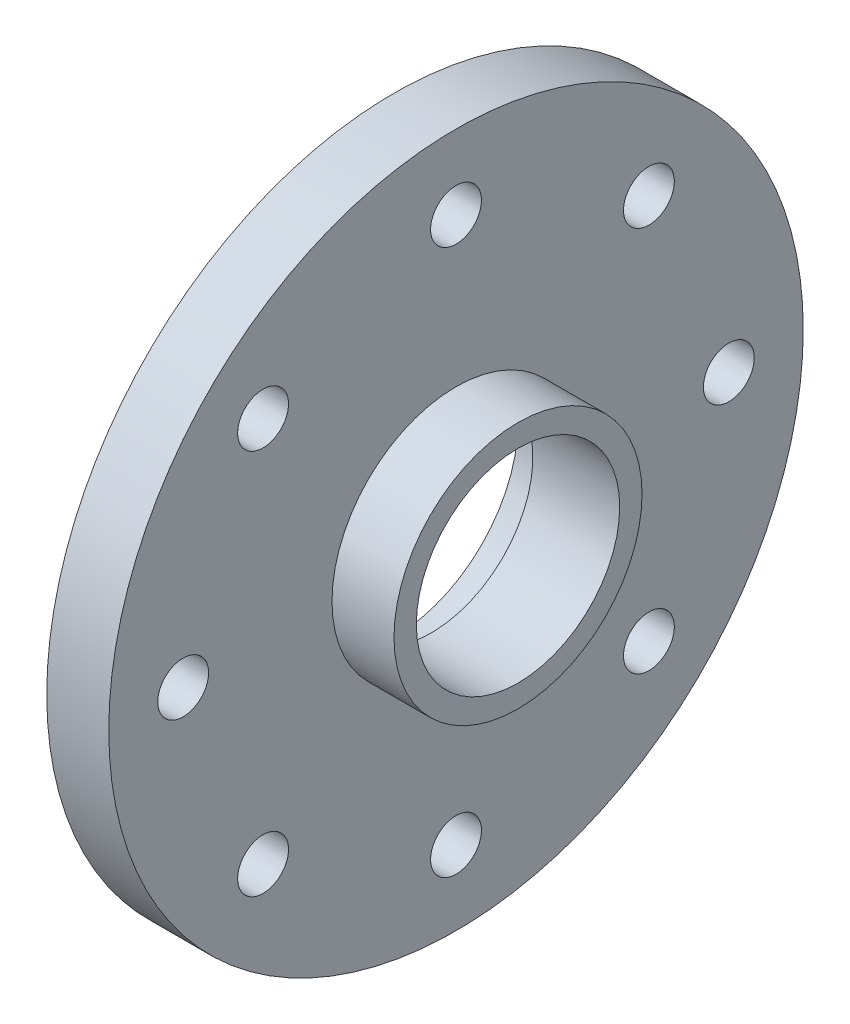
ISO-10303-21;
HEADER;
FILE_DESCRIPTION(('STEP AP214'),'2;1');
FILE_NAME('part.step','',(''),(''),'','','');
FILE_SCHEMA(('AUTOMOTIVE_DESIGN { 1 0 10303 214 1 1 1 1 }'));
ENDSEC;
DATA;
#1=APPLICATION_CONTEXT('core data for automotive mechanical design processes');
#2=APPLICATION_PROTOCOL_DEFINITION('international standard','automotive_design',2000,#1);
#3=PRODUCT_CONTEXT('',#1,'mechanical');
#4=PRODUCT('Part','Part','',(#3));
#5=PRODUCT_RELATED_PRODUCT_CATEGORY('part','',(#4));
#6=PRODUCT_DEFINITION_FORMATION('','',#4);
#7=PRODUCT_DEFINITION_CONTEXT('part definition',#1,'design');
#8=PRODUCT_DEFINITION('design','',#6,#7);
#9=PRODUCT_DEFINITION_SHAPE('','',#8);
#10=(LENGTH_UNIT() NAMED_UNIT(*) SI_UNIT(.MILLI.,.METRE.));
#11=(NAMED_UNIT(*) PLANE_ANGLE_UNIT() SI_UNIT($,.RADIAN.));
#12=(NAMED_UNIT(*) SI_UNIT($,.STERADIAN.) SOLID_ANGLE_UNIT());
#13=UNCERTAINTY_MEASURE_WITH_UNIT(LENGTH_MEASURE(1.E-05),#10,'distance_accuracy_value','');
#14=(GEOMETRIC_REPRESENTATION_CONTEXT(3) GLOBAL_UNCERTAINTY_ASSIGNED_CONTEXT((#13)) GLOBAL_UNIT_ASSIGNED_CONTEXT((#10,
#11,#12)) REPRESENTATION_CONTEXT('',''));
#15=CARTESIAN_POINT('',(0.,0.,0.));
#16=DIRECTION('',(0.,0.,1.));
#17=DIRECTION('',(1.,0.,0.));
#18=AXIS2_PLACEMENT_3D('',#15,#16,#17);
#19=CARTESIAN_POINT('',(2.5,0.,0.));
#20=DIRECTION('',(-1.,0.,0.));
#21=DIRECTION('',(0.,0.,1.));
#22=AXIS2_PLACEMENT_3D('',#19,#20,#21);
#23=CYLINDRICAL_SURFACE('',#22,4.1);
#24=CARTESIAN_POINT('',(5.,0.,0.));
#25=DIRECTION('',(1.,0.,0.));
#26=DIRECTION('',(0.,0.,-1.));
#27=AXIS2_PLACEMENT_3D('',#24,#25,#26);
#28=CIRCLE('',#27,4.1);
#29=CARTESIAN_POINT('',(5.,0.,-4.1));
#30=VERTEX_POINT('',#29);
#31=EDGE_CURVE('E72',#30,#30,#28,.T.);
#32=ORIENTED_EDGE('',*,*,#31,.T.);
#33=EDGE_LOOP('',(#32));
#34=FACE_BOUND('',#33,.T.);
#35=CARTESIAN_POINT('',(1.5,0.,0.));
#36=DIRECTION('',(-1.,0.,0.));
#37=DIRECTION('',(0.,0.,1.));
#38=AXIS2_PLACEMENT_3D('',#35,#36,#37);
#39=CIRCLE('',#38,4.1);
#40=CARTESIAN_POINT('',(1.5,0.,4.1));
#41=VERTEX_POINT('',#40);
#42=EDGE_CURVE('E53',#41,#41,#39,.T.);
#43=ORIENTED_EDGE('',*,*,#42,.T.);
#44=EDGE_LOOP('',(#43));
#45=FACE_BOUND('',#44,.T.);
#46=ADVANCED_FACE('F49',(#34,#45),#23,.F.);
#47=CARTESIAN_POINT('',(2.5,0.,0.));
#48=DIRECTION('',(1.,0.,0.));
#49=DIRECTION('',(0.,0.,-1.));
#50=AXIS2_PLACEMENT_3D('',#47,#48,#49);
#51=PLANE('',#50);
#52=CARTESIAN_POINT('',(2.5,11.,0.));
#53=DIRECTION('',(1.,0.,0.));
#54=DIRECTION('',(0.,0.,-1.));
#55=AXIS2_PLACEMENT_3D('',#52,#53,#54);
#56=CIRCLE('',#55,1.02499999999999);
#57=CARTESIAN_POINT('',(2.5,11.,-1.02499999999999));
#58=VERTEX_POINT('',#57);
#59=EDGE_CURVE('E134',#58,#58,#56,.T.);
#60=ORIENTED_EDGE('',*,*,#59,.F.);
#61=EDGE_LOOP('',(#60));
#62=FACE_BOUND('',#61,.T.);
#63=CARTESIAN_POINT('',(2.5,7.77817459305257,-7.77817459305225));
#64=DIRECTION('',(1.,0.,0.));
#65=DIRECTION('',(0.,0.,-1.));
#66=AXIS2_PLACEMENT_3D('',#63,#64,#65);
#67=CIRCLE('',#66,1.02499999999999);
#68=CARTESIAN_POINT('',(2.5,7.77817459305257,-8.80317459305224));
#69=VERTEX_POINT('',#68);
#70=EDGE_CURVE('E127',#69,#69,#67,.T.);
#71=ORIENTED_EDGE('',*,*,#70,.F.);
#72=EDGE_LOOP('',(#71));
#73=FACE_BOUND('',#72,.T.);
#74=CARTESIAN_POINT('',(2.5,7.80249897857048E-13,-11.0000000000008));
#75=DIRECTION('',(1.,0.,0.));
#76=DIRECTION('',(0.,0.,-1.));
#77=AXIS2_PLACEMENT_3D('',#74,#75,#76);
#78=CIRCLE('',#77,1.02499999999999);
#79=CARTESIAN_POINT('',(2.5,7.80249897857048E-13,-12.0250000000008));
#80=VERTEX_POINT('',#79);
#81=EDGE_CURVE('E119',#80,#80,#78,.T.);
#82=ORIENTED_EDGE('',*,*,#81,.F.);
#83=EDGE_LOOP('',(#82));
#84=FACE_BOUND('',#83,.T.);
#85=CARTESIAN_POINT('',(2.5,-7.77817459305147,-7.77817459305335));
#86=DIRECTION('',(1.,0.,0.));
#87=DIRECTION('',(0.,0.,-1.));
#88=AXIS2_PLACEMENT_3D('',#85,#86,#87);
#89=CIRCLE('',#88,1.02499999999999);
#90=CARTESIAN_POINT('',(2.5,-7.77817459305147,-8.80317459305335));
#91=VERTEX_POINT('',#90);
#92=EDGE_CURVE('E111',#91,#91,#89,.T.);
#93=ORIENTED_EDGE('',*,*,#92,.F.);
#94=EDGE_LOOP('',(#93));
#95=FACE_BOUND('',#94,.T.);
#96=CARTESIAN_POINT('',(2.5,-11.,-1.5604997957141E-12));
#97=DIRECTION('',(1.,0.,0.));
#98=DIRECTION('',(0.,0.,-1.));
#99=AXIS2_PLACEMENT_3D('',#96,#97,#98);
#100=CIRCLE('',#99,1.02499999999999);
#101=CARTESIAN_POINT('',(2.5,-11.,-1.02500000000155));
#102=VERTEX_POINT('',#101);
#103=EDGE_CURVE('E103',#102,#102,#100,.T.);
#104=ORIENTED_EDGE('',*,*,#103,.F.);
#105=EDGE_LOOP('',(#104));
#106=FACE_BOUND('',#105,.T.);
#107=CARTESIAN_POINT('',(2.5,-7.77817459305258,7.77817459305069));
#108=DIRECTION('',(1.,0.,0.));
#109=DIRECTION('',(0.,0.,-1.));
#110=AXIS2_PLACEMENT_3D('',#107,#108,#109);
#111=CIRCLE('',#110,1.02499999999999);
#112=CARTESIAN_POINT('',(2.5,-7.77817459305258,6.7531745930507));
#113=VERTEX_POINT('',#112);
#114=EDGE_CURVE('E95',#113,#113,#111,.T.);
#115=ORIENTED_EDGE('',*,*,#114,.F.);
#116=EDGE_LOOP('',(#115));
#117=FACE_BOUND('',#116,.T.);
#118=CARTESIAN_POINT('',(2.5,-7.8159700933611E-13,10.9999999999992));
#119=DIRECTION('',(1.,0.,0.));
#120=DIRECTION('',(0.,0.,-1.));
#121=AXIS2_PLACEMENT_3D('',#118,#119,#120);
#122=CIRCLE('',#121,1.02499999999999);
#123=CARTESIAN_POINT('',(2.5,-7.8159700933611E-13,9.97499999999923));
#124=VERTEX_POINT('',#123);
#125=EDGE_CURVE('E87',#124,#124,#122,.T.);
#126=ORIENTED_EDGE('',*,*,#125,.F.);
#127=EDGE_LOOP('',(#126));
#128=FACE_BOUND('',#127,.T.);
#129=CARTESIAN_POINT('',(2.5,7.77817459305147,7.77817459305179));
#130=DIRECTION('',(1.,0.,0.));
#131=DIRECTION('',(0.,0.,-1.));
#132=AXIS2_PLACEMENT_3D('',#129,#130,#131);
#133=CIRCLE('',#132,1.02499999999999);
#134=CARTESIAN_POINT('',(2.5,7.77817459305147,6.7531745930518));
#135=VERTEX_POINT('',#134);
#136=EDGE_CURVE('E79',#135,#135,#133,.T.);
#137=ORIENTED_EDGE('',*,*,#136,.F.);
#138=EDGE_LOOP('',(#137));
#139=FACE_BOUND('',#138,.T.);
#140=CARTESIAN_POINT('',(2.5,0.,0.));
#141=DIRECTION('',(1.,0.,0.));
#142=DIRECTION('',(0.,0.,-1.));
#143=AXIS2_PLACEMENT_3D('',#140,#141,#142);
#144=CIRCLE('',#143,14.);
#145=CARTESIAN_POINT('',(2.5,0.,-14.));
#146=VERTEX_POINT('',#145);
#147=EDGE_CURVE('E10',#146,#146,#144,.T.);
#148=ORIENTED_EDGE('',*,*,#147,.T.);
#149=EDGE_LOOP('',(#148));
#150=FACE_BOUND('',#149,.T.);
#151=CARTESIAN_POINT('',(2.5,0.,0.));
#152=DIRECTION('',(1.,0.,0.));
#153=DIRECTION('',(0.,0.,-1.));
#154=AXIS2_PLACEMENT_3D('',#151,#152,#153);
#155=CIRCLE('',#154,5.);
#156=CARTESIAN_POINT('',(2.5,0.,-5.));
#157=VERTEX_POINT('',#156);
#158=EDGE_CURVE('E68',#157,#157,#155,.T.);
#159=ORIENTED_EDGE('',*,*,#158,.F.);
#160=EDGE_LOOP('',(#159));
#161=FACE_BOUND('',#160,.T.);
#162=ADVANCED_FACE('F165',(#62,#73,#84,#95,#106,#117,#128,#139,#150,#161),#51,.T.);
#163=CARTESIAN_POINT('',(0.,0.,0.));
#164=DIRECTION('',(1.,0.,0.));
#165=DIRECTION('',(0.,0.,-1.));
#166=AXIS2_PLACEMENT_3D('',#163,#164,#165);
#167=PLANE('',#166);
#168=CARTESIAN_POINT('',(0.,0.,0.));
#169=DIRECTION('',(-1.,0.,0.));
#170=DIRECTION('',(0.,0.,1.));
#171=AXIS2_PLACEMENT_3D('',#168,#169,#170);
#172=CIRCLE('',#171,5.);
#173=CARTESIAN_POINT('',(0.,0.,5.));
#174=VERTEX_POINT('',#173);
#175=EDGE_CURVE('E141',#174,#174,#172,.T.);
#176=ORIENTED_EDGE('',*,*,#175,.F.);
#177=EDGE_LOOP('',(#176));
#178=FACE_BOUND('',#177,.T.);
#179=CARTESIAN_POINT('',(0.,11.,0.));
#180=DIRECTION('',(1.,0.,0.));
#181=DIRECTION('',(0.,0.,-1.));
#182=AXIS2_PLACEMENT_3D('',#179,#180,#181);
#183=CIRCLE('',#182,1.025);
#184=CARTESIAN_POINT('',(0.,11.,-1.025));
#185=VERTEX_POINT('',#184);
#186=EDGE_CURVE('E138',#185,#185,#183,.T.);
#187=ORIENTED_EDGE('',*,*,#186,.T.);
#188=EDGE_LOOP('',(#187));
#189=FACE_BOUND('',#188,.T.);
#190=CARTESIAN_POINT('',(0.,7.77817459305257,-7.77817459305225));
#191=DIRECTION('',(1.,0.,0.));
#192=DIRECTION('',(0.,0.,-1.));
#193=AXIS2_PLACEMENT_3D('',#190,#191,#192);
#194=CIRCLE('',#193,1.025);
#195=CARTESIAN_POINT('',(0.,7.77817459305257,-8.80317459305225));
#196=VERTEX_POINT('',#195);
#197=EDGE_CURVE('E131',#196,#196,#194,.T.);
#198=ORIENTED_EDGE('',*,*,#197,.T.);
#199=EDGE_LOOP('',(#198));
#200=FACE_BOUND('',#199,.T.);
#201=CARTESIAN_POINT('',(0.,7.80249897857048E-13,-11.0000000000008));
#202=DIRECTION('',(1.,0.,0.));
#203=DIRECTION('',(0.,0.,-1.));
#204=AXIS2_PLACEMENT_3D('',#201,#202,#203);
#205=CIRCLE('',#204,1.025);
#206=CARTESIAN_POINT('',(0.,7.80249897857048E-13,-12.0250000000008));
#207=VERTEX_POINT('',#206);
#208=EDGE_CURVE('E123',#207,#207,#205,.T.);
#209=ORIENTED_EDGE('',*,*,#208,.T.);
#210=EDGE_LOOP('',(#209));
#211=FACE_BOUND('',#210,.T.);
#212=CARTESIAN_POINT('',(0.,-7.77817459305147,-7.77817459305335));
#213=DIRECTION('',(1.,0.,0.));
#214=DIRECTION('',(0.,0.,-1.));
#215=AXIS2_PLACEMENT_3D('',#212,#213,#214);
#216=CIRCLE('',#215,1.025);
#217=CARTESIAN_POINT('',(0.,-7.77817459305147,-8.80317459305335));
#218=VERTEX_POINT('',#217);
#219=EDGE_CURVE('E115',#218,#218,#216,.T.);
#220=ORIENTED_EDGE('',*,*,#219,.T.);
#221=EDGE_LOOP('',(#220));
#222=FACE_BOUND('',#221,.T.);
#223=CARTESIAN_POINT('',(0.,-11.,-1.5604997957141E-12));
#224=DIRECTION('',(1.,0.,0.));
#225=DIRECTION('',(0.,0.,-1.));
#226=AXIS2_PLACEMENT_3D('',#223,#224,#225);
#227=CIRCLE('',#226,1.025);
#228=CARTESIAN_POINT('',(0.,-11.,-1.02500000000156));
#229=VERTEX_POINT('',#228);
#230=EDGE_CURVE('E107',#229,#229,#227,.T.);
#231=ORIENTED_EDGE('',*,*,#230,.T.);
#232=EDGE_LOOP('',(#231));
#233=FACE_BOUND('',#232,.T.);
#234=CARTESIAN_POINT('',(0.,-7.77817459305258,7.77817459305069));
#235=DIRECTION('',(1.,0.,0.));
#236=DIRECTION('',(0.,0.,-1.));
#237=AXIS2_PLACEMENT_3D('',#234,#235,#236);
#238=CIRCLE('',#237,1.025);
#239=CARTESIAN_POINT('',(0.,-7.77817459305258,6.75317459305069));
#240=VERTEX_POINT('',#239);
#241=EDGE_CURVE('E99',#240,#240,#238,.T.);
#242=ORIENTED_EDGE('',*,*,#241,.T.);
#243=EDGE_LOOP('',(#242));
#244=FACE_BOUND('',#243,.T.);
#245=CARTESIAN_POINT('',(0.,-7.8159700933611E-13,10.9999999999992));
#246=DIRECTION('',(1.,0.,0.));
#247=DIRECTION('',(0.,0.,-1.));
#248=AXIS2_PLACEMENT_3D('',#245,#246,#247);
#249=CIRCLE('',#248,1.025);
#250=CARTESIAN_POINT('',(0.,-7.8159700933611E-13,9.97499999999922));
#251=VERTEX_POINT('',#250);
#252=EDGE_CURVE('E91',#251,#251,#249,.T.);
#253=ORIENTED_EDGE('',*,*,#252,.T.);
#254=EDGE_LOOP('',(#253));
#255=FACE_BOUND('',#254,.T.);
#256=CARTESIAN_POINT('',(0.,7.77817459305147,7.77817459305179));
#257=DIRECTION('',(1.,0.,0.));
#258=DIRECTION('',(0.,0.,-1.));
#259=AXIS2_PLACEMENT_3D('',#256,#257,#258);
#260=CIRCLE('',#259,1.025);
#261=CARTESIAN_POINT('',(0.,7.77817459305147,6.75317459305179));
#262=VERTEX_POINT('',#261);
#263=EDGE_CURVE('E83',#262,#262,#260,.T.);
#264=ORIENTED_EDGE('',*,*,#263,.T.);
#265=EDGE_LOOP('',(#264));
#266=FACE_BOUND('',#265,.T.);
#267=CARTESIAN_POINT('',(0.,0.,0.));
#268=DIRECTION('',(1.,0.,0.));
#269=DIRECTION('',(0.,0.,-1.));
#270=AXIS2_PLACEMENT_3D('',#267,#268,#269);
#271=CIRCLE('',#270,14.);
#272=CARTESIAN_POINT('',(0.,0.,-14.));
#273=VERTEX_POINT('',#272);
#274=EDGE_CURVE('E58',#273,#273,#271,.T.);
#275=ORIENTED_EDGE('',*,*,#274,.F.);
#276=EDGE_LOOP('',(#275));
#277=FACE_BOUND('',#276,.T.);
#278=ADVANCED_FACE('F171',(#178,#189,#200,#211,#222,#233,#244,#255,#266,#277),#167,.F.);
#279=CARTESIAN_POINT('',(2.5,0.,0.));
#280=DIRECTION('',(-1.,0.,0.));
#281=DIRECTION('',(0.,0.,1.));
#282=AXIS2_PLACEMENT_3D('',#279,#280,#281);
#283=CYLINDRICAL_SURFACE('',#282,14.);
#284=ORIENTED_EDGE('',*,*,#147,.F.);
#285=EDGE_LOOP('',(#284));
#286=FACE_BOUND('',#285,.T.);
#287=ORIENTED_EDGE('',*,*,#274,.T.);
#288=EDGE_LOOP('',(#287));
#289=FACE_BOUND('',#288,.T.);
#290=ADVANCED_FACE('F51',(#286,#289),#283,.T.);
#291=CARTESIAN_POINT('',(5.,0.,0.));
#292=DIRECTION('',(1.,0.,0.));
#293=DIRECTION('',(0.,0.,-1.));
#294=AXIS2_PLACEMENT_3D('',#291,#292,#293);
#295=PLANE('',#294);
#296=CARTESIAN_POINT('',(5.,0.,0.));
#297=DIRECTION('',(1.,0.,0.));
#298=DIRECTION('',(0.,0.,-1.));
#299=AXIS2_PLACEMENT_3D('',#296,#297,#298);
#300=CIRCLE('',#299,5.);
#301=CARTESIAN_POINT('',(5.,0.,-5.));
#302=VERTEX_POINT('',#301);
#303=EDGE_CURVE('E66',#302,#302,#300,.T.);
#304=ORIENTED_EDGE('',*,*,#303,.T.);
#305=EDGE_LOOP('',(#304));
#306=FACE_BOUND('',#305,.T.);
#307=ORIENTED_EDGE('',*,*,#31,.F.);
#308=EDGE_LOOP('',(#307));
#309=FACE_BOUND('',#308,.T.);
#310=ADVANCED_FACE('F181',(#306,#309),#295,.T.);
#311=CARTESIAN_POINT('',(5.,0.,0.));
#312=DIRECTION('',(-1.,0.,0.));
#313=DIRECTION('',(0.,0.,1.));
#314=AXIS2_PLACEMENT_3D('',#311,#312,#313);
#315=CYLINDRICAL_SURFACE('',#314,5.);
#316=ORIENTED_EDGE('',*,*,#303,.F.);
#317=EDGE_LOOP('',(#316));
#318=FACE_BOUND('',#317,.T.);
#319=ORIENTED_EDGE('',*,*,#158,.T.);
#320=EDGE_LOOP('',(#319));
#321=FACE_BOUND('',#320,.T.);
#322=ADVANCED_FACE('F175',(#318,#321),#315,.T.);
#323=CARTESIAN_POINT('',(5.,7.77817459305147,7.77817459305179));
#324=DIRECTION('',(1.,0.,0.));
#325=DIRECTION('',(0.,0.,-1.));
#326=AXIS2_PLACEMENT_3D('',#323,#324,#325);
#327=CYLINDRICAL_SURFACE('',#326,1.02499999999999);
#328=ORIENTED_EDGE('',*,*,#136,.T.);
#329=EDGE_LOOP('',(#328));
#330=FACE_BOUND('',#329,.T.);
#331=ORIENTED_EDGE('',*,*,#263,.F.);
#332=EDGE_LOOP('',(#331));
#333=FACE_BOUND('',#332,.T.);
#334=ADVANCED_FACE('F204',(#330,#333),#327,.F.);
#335=CARTESIAN_POINT('',(5.,-7.8159700933611E-13,10.9999999999992));
#336=DIRECTION('',(1.,0.,0.));
#337=DIRECTION('',(0.,0.,-1.));
#338=AXIS2_PLACEMENT_3D('',#335,#336,#337);
#339=CYLINDRICAL_SURFACE('',#338,1.02499999999999);
#340=ORIENTED_EDGE('',*,*,#125,.T.);
#341=EDGE_LOOP('',(#340));
#342=FACE_BOUND('',#341,.T.);
#343=ORIENTED_EDGE('',*,*,#252,.F.);
#344=EDGE_LOOP('',(#343));
#345=FACE_BOUND('',#344,.T.);
#346=ADVANCED_FACE('F206',(#342,#345),#339,.F.);
#347=CARTESIAN_POINT('',(5.,-7.77817459305258,7.77817459305069));
#348=DIRECTION('',(1.,0.,0.));
#349=DIRECTION('',(0.,0.,-1.));
#350=AXIS2_PLACEMENT_3D('',#347,#348,#349);
#351=CYLINDRICAL_SURFACE('',#350,1.02499999999999);
#352=ORIENTED_EDGE('',*,*,#114,.T.);
#353=EDGE_LOOP('',(#352));
#354=FACE_BOUND('',#353,.T.);
#355=ORIENTED_EDGE('',*,*,#241,.F.);
#356=EDGE_LOOP('',(#355));
#357=FACE_BOUND('',#356,.T.);
#358=ADVANCED_FACE('F212',(#354,#357),#351,.F.);
#359=CARTESIAN_POINT('',(5.,-11.,-1.5604997957141E-12));
#360=DIRECTION('',(1.,0.,0.));
#361=DIRECTION('',(0.,0.,-1.));
#362=AXIS2_PLACEMENT_3D('',#359,#360,#361);
#363=CYLINDRICAL_SURFACE('',#362,1.02499999999999);
#364=ORIENTED_EDGE('',*,*,#103,.T.);
#365=EDGE_LOOP('',(#364));
#366=FACE_BOUND('',#365,.T.);
#367=ORIENTED_EDGE('',*,*,#230,.F.);
#368=EDGE_LOOP('',(#367));
#369=FACE_BOUND('',#368,.T.);
#370=ADVANCED_FACE('F250',(#366,#369),#363,.F.);
#371=CARTESIAN_POINT('',(5.,-7.77817459305147,-7.77817459305335));
#372=DIRECTION('',(1.,0.,0.));
#373=DIRECTION('',(0.,0.,-1.));
#374=AXIS2_PLACEMENT_3D('',#371,#372,#373);
#375=CYLINDRICAL_SURFACE('',#374,1.02499999999999);
#376=ORIENTED_EDGE('',*,*,#92,.T.);
#377=EDGE_LOOP('',(#376));
#378=FACE_BOUND('',#377,.T.);
#379=ORIENTED_EDGE('',*,*,#219,.F.);
#380=EDGE_LOOP('',(#379));
#381=FACE_BOUND('',#380,.T.);
#382=ADVANCED_FACE('F259',(#378,#381),#375,.F.);
#383=CARTESIAN_POINT('',(5.,7.80249897857048E-13,-11.0000000000008));
#384=DIRECTION('',(1.,0.,0.));
#385=DIRECTION('',(0.,0.,-1.));
#386=AXIS2_PLACEMENT_3D('',#383,#384,#385);
#387=CYLINDRICAL_SURFACE('',#386,1.02499999999999);
#388=ORIENTED_EDGE('',*,*,#81,.T.);
#389=EDGE_LOOP('',(#388));
#390=FACE_BOUND('',#389,.T.);
#391=ORIENTED_EDGE('',*,*,#208,.F.);
#392=EDGE_LOOP('',(#391));
#393=FACE_BOUND('',#392,.T.);
#394=ADVANCED_FACE('F269',(#390,#393),#387,.F.);
#395=CARTESIAN_POINT('',(5.,7.77817459305257,-7.77817459305225));
#396=DIRECTION('',(1.,0.,0.));
#397=DIRECTION('',(0.,0.,-1.));
#398=AXIS2_PLACEMENT_3D('',#395,#396,#397);
#399=CYLINDRICAL_SURFACE('',#398,1.02499999999999);
#400=ORIENTED_EDGE('',*,*,#70,.T.);
#401=EDGE_LOOP('',(#400));
#402=FACE_BOUND('',#401,.T.);
#403=ORIENTED_EDGE('',*,*,#197,.F.);
#404=EDGE_LOOP('',(#403));
#405=FACE_BOUND('',#404,.T.);
#406=ADVANCED_FACE('F279',(#402,#405),#399,.F.);
#407=CARTESIAN_POINT('',(5.,11.,0.));
#408=DIRECTION('',(1.,0.,0.));
#409=DIRECTION('',(0.,0.,-1.));
#410=AXIS2_PLACEMENT_3D('',#407,#408,#409);
#411=CYLINDRICAL_SURFACE('',#410,1.02499999999999);
#412=ORIENTED_EDGE('',*,*,#59,.T.);
#413=EDGE_LOOP('',(#412));
#414=FACE_BOUND('',#413,.T.);
#415=ORIENTED_EDGE('',*,*,#186,.F.);
#416=EDGE_LOOP('',(#415));
#417=FACE_BOUND('',#416,.T.);
#418=ADVANCED_FACE('F161',(#414,#417),#411,.F.);
#419=CARTESIAN_POINT('',(1.5,0.,0.));
#420=DIRECTION('',(-1.,0.,0.));
#421=DIRECTION('',(0.,0.,1.));
#422=AXIS2_PLACEMENT_3D('',#419,#420,#421);
#423=CYLINDRICAL_SURFACE('',#422,5.);
#424=CARTESIAN_POINT('',(1.5,0.,0.));
#425=DIRECTION('',(-1.,0.,0.));
#426=DIRECTION('',(0.,0.,1.));
#427=AXIS2_PLACEMENT_3D('',#424,#425,#426);
#428=CIRCLE('',#427,5.);
#429=CARTESIAN_POINT('',(1.5,0.,5.));
#430=VERTEX_POINT('',#429);
#431=EDGE_CURVE('E145',#430,#430,#428,.T.);
#432=ORIENTED_EDGE('',*,*,#431,.F.);
#433=EDGE_LOOP('',(#432));
#434=FACE_BOUND('',#433,.T.);
#435=ORIENTED_EDGE('',*,*,#175,.T.);
#436=EDGE_LOOP('',(#435));
#437=FACE_BOUND('',#436,.T.);
#438=ADVANCED_FACE('F157',(#434,#437),#423,.F.);
#439=CARTESIAN_POINT('',(1.5,0.,0.));
#440=DIRECTION('',(-1.,0.,0.));
#441=DIRECTION('',(0.,0.,1.));
#442=AXIS2_PLACEMENT_3D('',#439,#440,#441);
#443=PLANE('',#442);
#444=ORIENTED_EDGE('',*,*,#42,.F.);
#445=EDGE_LOOP('',(#444));
#446=FACE_BOUND('',#445,.T.);
#447=ORIENTED_EDGE('',*,*,#431,.T.);
#448=EDGE_LOOP('',(#447));
#449=FACE_BOUND('',#448,.T.);
#450=ADVANCED_FACE('F155',(#446,#449),#443,.T.);
#451=CLOSED_SHELL('',(#46,#162,#278,#290,#310,#322,#334,#346,#358,#370,#382,#394,#406,#418,#438,#450));
#452=MANIFOLD_SOLID_BREP('B2',#451);
#453=ADVANCED_BREP_SHAPE_REPRESENTATION('',(#18,#452),#14);
#454=SHAPE_DEFINITION_REPRESENTATION(#9,#453);
ENDSEC;
END-ISO-10303-21;
